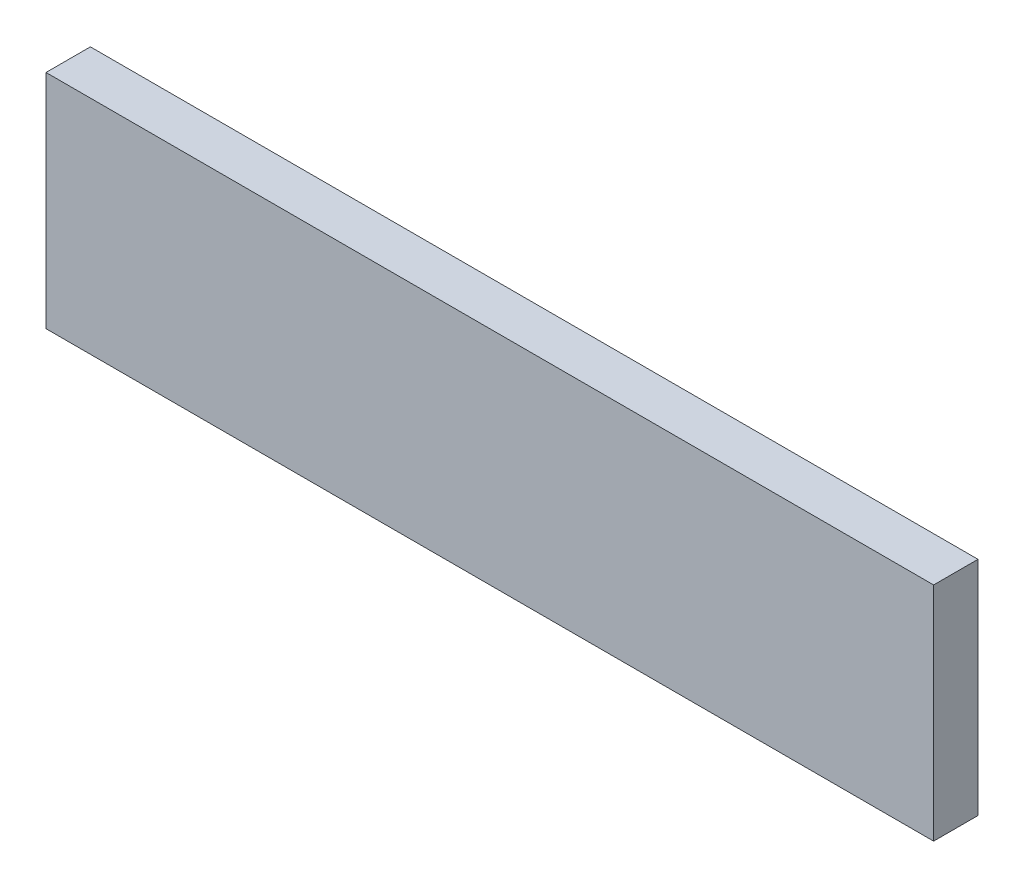
ISO-10303-21;
HEADER;
FILE_DESCRIPTION(('STEP AP214'),'2;1');
FILE_NAME('part.step','',(''),(''),'','','');
FILE_SCHEMA(('AUTOMOTIVE_DESIGN { 1 0 10303 214 1 1 1 1 }'));
ENDSEC;
DATA;
#1=APPLICATION_CONTEXT('core data for automotive mechanical design processes');
#2=APPLICATION_PROTOCOL_DEFINITION('international standard','automotive_design',2000,#1);
#3=PRODUCT_CONTEXT('',#1,'mechanical');
#4=PRODUCT('Part','Part','',(#3));
#5=PRODUCT_RELATED_PRODUCT_CATEGORY('part','',(#4));
#6=PRODUCT_DEFINITION_FORMATION('','',#4);
#7=PRODUCT_DEFINITION_CONTEXT('part definition',#1,'design');
#8=PRODUCT_DEFINITION('design','',#6,#7);
#9=PRODUCT_DEFINITION_SHAPE('','',#8);
#10=(LENGTH_UNIT() NAMED_UNIT(*) SI_UNIT(.MILLI.,.METRE.));
#11=(NAMED_UNIT(*) PLANE_ANGLE_UNIT() SI_UNIT($,.RADIAN.));
#12=(NAMED_UNIT(*) SI_UNIT($,.STERADIAN.) SOLID_ANGLE_UNIT());
#13=UNCERTAINTY_MEASURE_WITH_UNIT(LENGTH_MEASURE(1.E-05),#10,'distance_accuracy_value','');
#14=(GEOMETRIC_REPRESENTATION_CONTEXT(3) GLOBAL_UNCERTAINTY_ASSIGNED_CONTEXT((#13)) GLOBAL_UNIT_ASSIGNED_CONTEXT((#10,
#11,#12)) REPRESENTATION_CONTEXT('',''));
#15=CARTESIAN_POINT('',(0.,0.,0.));
#16=DIRECTION('',(0.,0.,1.));
#17=DIRECTION('',(1.,0.,0.));
#18=AXIS2_PLACEMENT_3D('',#15,#16,#17);
#19=CARTESIAN_POINT('',(200.,0.,0.));
#20=DIRECTION('',(0.,0.,-1.));
#21=DIRECTION('',(-1.,0.,0.));
#22=AXIS2_PLACEMENT_3D('',#19,#20,#21);
#23=PLANE('',#22);
#24=DIRECTION('',(0.,-1.,0.));
#25=VECTOR('',#24,1.);
#26=CARTESIAN_POINT('',(0.,0.,0.));
#27=LINE('',#26,#25);
#28=CARTESIAN_POINT('',(0.,50.,0.));
#29=VERTEX_POINT('',#28);
#30=CARTESIAN_POINT('',(0.,0.,0.));
#31=VERTEX_POINT('',#30);
#32=EDGE_CURVE('E100',#29,#31,#27,.T.);
#33=ORIENTED_EDGE('',*,*,#32,.T.);
#34=DIRECTION('',(-1.,0.,0.));
#35=VECTOR('',#34,1.);
#36=CARTESIAN_POINT('',(200.,0.,0.));
#37=LINE('',#36,#35);
#38=CARTESIAN_POINT('',(200.,0.,0.));
#39=VERTEX_POINT('',#38);
#40=EDGE_CURVE('E11',#39,#31,#37,.T.);
#41=ORIENTED_EDGE('',*,*,#40,.F.);
#42=DIRECTION('',(0.,-1.,0.));
#43=VECTOR('',#42,1.);
#44=CARTESIAN_POINT('',(200.,0.,0.));
#45=LINE('',#44,#43);
#46=CARTESIAN_POINT('',(200.,50.,0.));
#47=VERTEX_POINT('',#46);
#48=EDGE_CURVE('E88',#47,#39,#45,.T.);
#49=ORIENTED_EDGE('',*,*,#48,.F.);
#50=DIRECTION('',(-1.,0.,0.));
#51=VECTOR('',#50,1.);
#52=CARTESIAN_POINT('',(200.,50.,0.));
#53=LINE('',#52,#51);
#54=EDGE_CURVE('E96',#47,#29,#53,.T.);
#55=ORIENTED_EDGE('',*,*,#54,.T.);
#56=EDGE_LOOP('',(#33,#41,#49,#55));
#57=FACE_BOUND('',#56,.T.);
#58=ADVANCED_FACE('F37',(#57),#23,.F.);
#59=CARTESIAN_POINT('',(200.,0.,0.));
#60=DIRECTION('',(0.,1.,0.));
#61=DIRECTION('',(0.,0.,1.));
#62=AXIS2_PLACEMENT_3D('',#59,#60,#61);
#63=PLANE('',#62);
#64=DIRECTION('',(0.,0.,-1.));
#65=VECTOR('',#64,1.);
#66=CARTESIAN_POINT('',(0.,0.,0.));
#67=LINE('',#66,#65);
#68=CARTESIAN_POINT('',(0.,0.,-10.));
#69=VERTEX_POINT('',#68);
#70=EDGE_CURVE('E92',#31,#69,#67,.T.);
#71=ORIENTED_EDGE('',*,*,#70,.T.);
#72=DIRECTION('',(-1.,0.,0.));
#73=VECTOR('',#72,1.);
#74=CARTESIAN_POINT('',(200.,0.,-10.));
#75=LINE('',#74,#73);
#76=CARTESIAN_POINT('',(200.,0.,-10.));
#77=VERTEX_POINT('',#76);
#78=EDGE_CURVE('E45',#77,#69,#75,.T.);
#79=ORIENTED_EDGE('',*,*,#78,.F.);
#80=DIRECTION('',(0.,0.,-1.));
#81=VECTOR('',#80,1.);
#82=CARTESIAN_POINT('',(200.,0.,0.));
#83=LINE('',#82,#81);
#84=EDGE_CURVE('E83',#39,#77,#83,.T.);
#85=ORIENTED_EDGE('',*,*,#84,.F.);
#86=ORIENTED_EDGE('',*,*,#40,.T.);
#87=EDGE_LOOP('',(#71,#79,#85,#86));
#88=FACE_BOUND('',#87,.T.);
#89=ADVANCED_FACE('F91',(#88),#63,.F.);
#90=CARTESIAN_POINT('',(200.,0.,-10.));
#91=DIRECTION('',(0.,0.,1.));
#92=DIRECTION('',(1.,0.,0.));
#93=AXIS2_PLACEMENT_3D('',#90,#91,#92);
#94=PLANE('',#93);
#95=DIRECTION('',(0.,1.,0.));
#96=VECTOR('',#95,1.);
#97=CARTESIAN_POINT('',(0.,0.,-10.));
#98=LINE('',#97,#96);
#99=CARTESIAN_POINT('',(0.,50.,-10.));
#100=VERTEX_POINT('',#99);
#101=EDGE_CURVE('E70',#69,#100,#98,.T.);
#102=ORIENTED_EDGE('',*,*,#101,.T.);
#103=DIRECTION('',(-1.,0.,0.));
#104=VECTOR('',#103,1.);
#105=CARTESIAN_POINT('',(200.,50.,-10.));
#106=LINE('',#105,#104);
#107=CARTESIAN_POINT('',(200.,50.,-10.));
#108=VERTEX_POINT('',#107);
#109=EDGE_CURVE('E93',#108,#100,#106,.T.);
#110=ORIENTED_EDGE('',*,*,#109,.F.);
#111=DIRECTION('',(0.,1.,0.));
#112=VECTOR('',#111,1.);
#113=CARTESIAN_POINT('',(200.,0.,-10.));
#114=LINE('',#113,#112);
#115=EDGE_CURVE('E86',#77,#108,#114,.T.);
#116=ORIENTED_EDGE('',*,*,#115,.F.);
#117=ORIENTED_EDGE('',*,*,#78,.T.);
#118=EDGE_LOOP('',(#102,#110,#116,#117));
#119=FACE_BOUND('',#118,.T.);
#120=ADVANCED_FACE('F94',(#119),#94,.F.);
#121=CARTESIAN_POINT('',(200.,50.,0.));
#122=DIRECTION('',(0.,-1.,0.));
#123=DIRECTION('',(0.,0.,-1.));
#124=AXIS2_PLACEMENT_3D('',#121,#122,#123);
#125=PLANE('',#124);
#126=DIRECTION('',(0.,0.,1.));
#127=VECTOR('',#126,1.);
#128=CARTESIAN_POINT('',(0.,50.,0.));
#129=LINE('',#128,#127);
#130=EDGE_CURVE('E76',#100,#29,#129,.T.);
#131=ORIENTED_EDGE('',*,*,#130,.T.);
#132=ORIENTED_EDGE('',*,*,#54,.F.);
#133=DIRECTION('',(0.,0.,1.));
#134=VECTOR('',#133,1.);
#135=CARTESIAN_POINT('',(200.,50.,0.));
#136=LINE('',#135,#134);
#137=EDGE_CURVE('E53',#108,#47,#136,.T.);
#138=ORIENTED_EDGE('',*,*,#137,.F.);
#139=ORIENTED_EDGE('',*,*,#109,.T.);
#140=EDGE_LOOP('',(#131,#132,#138,#139));
#141=FACE_BOUND('',#140,.T.);
#142=ADVANCED_FACE('F107',(#141),#125,.F.);
#143=CARTESIAN_POINT('',(200.,0.,0.));
#144=DIRECTION('',(-1.,0.,0.));
#145=DIRECTION('',(0.,0.,1.));
#146=AXIS2_PLACEMENT_3D('',#143,#144,#145);
#147=PLANE('',#146);
#148=ORIENTED_EDGE('',*,*,#48,.T.);
#149=ORIENTED_EDGE('',*,*,#84,.T.);
#150=ORIENTED_EDGE('',*,*,#115,.T.);
#151=ORIENTED_EDGE('',*,*,#137,.T.);
#152=EDGE_LOOP('',(#148,#149,#150,#151));
#153=FACE_BOUND('',#152,.T.);
#154=ADVANCED_FACE('F84',(#153),#147,.F.);
#155=CARTESIAN_POINT('',(0.,0.,0.));
#156=DIRECTION('',(-1.,0.,0.));
#157=DIRECTION('',(0.,0.,1.));
#158=AXIS2_PLACEMENT_3D('',#155,#156,#157);
#159=PLANE('',#158);
#160=ORIENTED_EDGE('',*,*,#32,.F.);
#161=ORIENTED_EDGE('',*,*,#130,.F.);
#162=ORIENTED_EDGE('',*,*,#101,.F.);
#163=ORIENTED_EDGE('',*,*,#70,.F.);
#164=EDGE_LOOP('',(#160,#161,#162,#163));
#165=FACE_BOUND('',#164,.T.);
#166=ADVANCED_FACE('F110',(#165),#159,.T.);
#167=CLOSED_SHELL('',(#58,#89,#120,#142,#154,#166));
#168=MANIFOLD_SOLID_BREP('B2',#167);
#169=ADVANCED_BREP_SHAPE_REPRESENTATION('',(#18,#168),#14);
#170=SHAPE_DEFINITION_REPRESENTATION(#9,#169);
ENDSEC;
END-ISO-10303-21;
